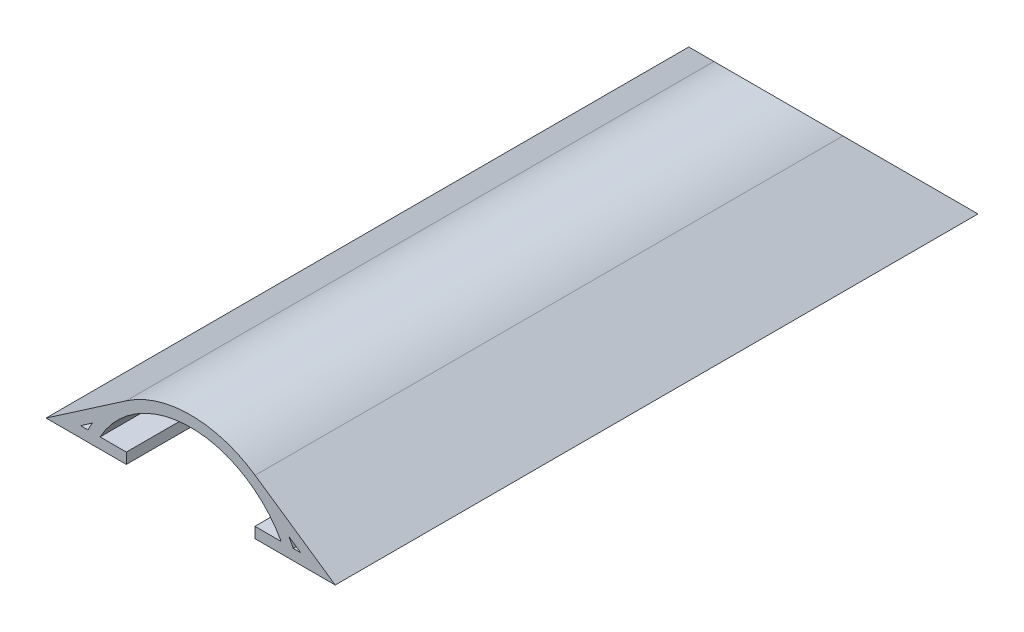
ISO-10303-21;
HEADER;
FILE_DESCRIPTION(('STEP AP214'),'2;1');
FILE_NAME('part.step','',(''),(''),'','','');
FILE_SCHEMA(('AUTOMOTIVE_DESIGN { 1 0 10303 214 1 1 1 1 }'));
ENDSEC;
DATA;
#1=APPLICATION_CONTEXT('core data for automotive mechanical design processes');
#2=APPLICATION_PROTOCOL_DEFINITION('international standard','automotive_design',2000,#1);
#3=PRODUCT_CONTEXT('',#1,'mechanical');
#4=PRODUCT('Part','Part','',(#3));
#5=PRODUCT_RELATED_PRODUCT_CATEGORY('part','',(#4));
#6=PRODUCT_DEFINITION_FORMATION('','',#4);
#7=PRODUCT_DEFINITION_CONTEXT('part definition',#1,'design');
#8=PRODUCT_DEFINITION('design','',#6,#7);
#9=PRODUCT_DEFINITION_SHAPE('','',#8);
#10=(LENGTH_UNIT() NAMED_UNIT(*) SI_UNIT(.MILLI.,.METRE.));
#11=(NAMED_UNIT(*) PLANE_ANGLE_UNIT() SI_UNIT($,.RADIAN.));
#12=(NAMED_UNIT(*) SI_UNIT($,.STERADIAN.) SOLID_ANGLE_UNIT());
#13=UNCERTAINTY_MEASURE_WITH_UNIT(LENGTH_MEASURE(1.E-05),#10,'distance_accuracy_value','');
#14=(GEOMETRIC_REPRESENTATION_CONTEXT(3) GLOBAL_UNCERTAINTY_ASSIGNED_CONTEXT((#13)) GLOBAL_UNIT_ASSIGNED_CONTEXT((#10,
#11,#12)) REPRESENTATION_CONTEXT('',''));
#15=CARTESIAN_POINT('',(0.,0.,0.));
#16=DIRECTION('',(0.,0.,1.));
#17=DIRECTION('',(1.,0.,0.));
#18=AXIS2_PLACEMENT_3D('',#15,#16,#17);
#19=CARTESIAN_POINT('',(34.29,-9.25285714285715,152.4));
#20=DIRECTION('',(0.,0.,-1.));
#21=DIRECTION('',(-1.,0.,0.));
#22=AXIS2_PLACEMENT_3D('',#19,#20,#21);
#23=CYLINDRICAL_SURFACE('',#22,27.0328571428572);
#24=CARTESIAN_POINT('',(34.29,-9.25285714285715,-9.25285714285704));
#25=DIRECTION('',(0.,0.707106781186544,-0.707106781186551));
#26=DIRECTION('',(0.,-0.707106781186551,-0.707106781186544));
#27=AXIS2_PLACEMENT_3D('',#24,#25,#26);
#28=ELLIPSE('',#27,38.2302332011228,27.0328571428572);
#29=CARTESIAN_POINT('',(18.9926798567758,13.0354214300123,13.0354214300122));
#30=VERTEX_POINT('',#29);
#31=CARTESIAN_POINT('',(49.5873201432242,13.0354214300123,13.0354214300122));
#32=VERTEX_POINT('',#31);
#33=EDGE_CURVE('E54',#30,#32,#28,.T.);
#34=ORIENTED_EDGE('',*,*,#33,.F.);
#35=DIRECTION('',(0.,0.,-1.));
#36=VECTOR('',#35,1.);
#37=CARTESIAN_POINT('',(18.9926798567758,13.0354214300123,152.4));
#38=LINE('',#37,#36);
#39=CARTESIAN_POINT('',(18.9926798567758,13.0354214300123,152.4));
#40=VERTEX_POINT('',#39);
#41=EDGE_CURVE('E39',#40,#30,#38,.T.);
#42=ORIENTED_EDGE('',*,*,#41,.F.);
#43=CARTESIAN_POINT('',(34.29,-9.25285714285715,152.4));
#44=DIRECTION('',(0.,0.,1.));
#45=DIRECTION('',(1.,0.,0.));
#46=AXIS2_PLACEMENT_3D('',#43,#44,#45);
#47=CIRCLE('',#46,27.0328571428572);
#48=CARTESIAN_POINT('',(49.5873201432242,13.0354214300123,152.4));
#49=VERTEX_POINT('',#48);
#50=EDGE_CURVE('E214',#49,#40,#47,.T.);
#51=ORIENTED_EDGE('',*,*,#50,.F.);
#52=DIRECTION('',(0.,0.,-1.));
#53=VECTOR('',#52,1.);
#54=CARTESIAN_POINT('',(49.5873201432242,13.0354214300123,152.4));
#55=LINE('',#54,#53);
#56=EDGE_CURVE('E223',#49,#32,#55,.T.);
#57=ORIENTED_EDGE('',*,*,#56,.T.);
#58=EDGE_LOOP('',(#34,#42,#51,#57));
#59=FACE_BOUND('',#58,.T.);
#60=ADVANCED_FACE('F32',(#59),#23,.T.);
#61=CARTESIAN_POINT('',(18.9926798567758,13.0354214300123,152.4));
#62=DIRECTION('',(0.565878777163079,-0.824488453258394,0.));
#63=DIRECTION('',(0.824488453258394,0.565878777163079,0.));
#64=AXIS2_PLACEMENT_3D('',#61,#62,#63);
#65=PLANE('',#64);
#66=DIRECTION('',(0.717565620621447,0.492493441632557,0.492493441632552));
#67=VECTOR('',#66,1.);
#68=CARTESIAN_POINT('',(68.2436149285987,46.8382707027199,46.8382707027194));
#69=LINE('',#68,#67);
#70=CARTESIAN_POINT('',(0.,0.,0.));
#71=VERTEX_POINT('',#70);
#72=EDGE_CURVE('E239',#71,#30,#69,.T.);
#73=ORIENTED_EDGE('',*,*,#72,.F.);
#74=DIRECTION('',(0.,0.,-1.));
#75=VECTOR('',#74,1.);
#76=CARTESIAN_POINT('',(0.,0.,152.4));
#77=LINE('',#76,#75);
#78=CARTESIAN_POINT('',(0.,0.,152.4));
#79=VERTEX_POINT('',#78);
#80=EDGE_CURVE('E231',#79,#71,#77,.T.);
#81=ORIENTED_EDGE('',*,*,#80,.F.);
#82=DIRECTION('',(-0.824488453258394,-0.565878777163079,0.));
#83=VECTOR('',#82,1.);
#84=CARTESIAN_POINT('',(18.9926798567758,13.0354214300123,152.4));
#85=LINE('',#84,#83);
#86=EDGE_CURVE('E217',#40,#79,#85,.T.);
#87=ORIENTED_EDGE('',*,*,#86,.F.);
#88=ORIENTED_EDGE('',*,*,#41,.T.);
#89=EDGE_LOOP('',(#73,#81,#87,#88));
#90=FACE_BOUND('',#89,.T.);
#91=ADVANCED_FACE('F237',(#90),#65,.F.);
#92=CARTESIAN_POINT('',(49.5873201432242,13.0354214300123,152.4));
#93=DIRECTION('',(-0.565878777163079,-0.824488453258394,0.));
#94=DIRECTION('',(0.824488453258394,-0.565878777163079,0.));
#95=AXIS2_PLACEMENT_3D('',#92,#93,#94);
#96=PLANE('',#95);
#97=DIRECTION('',(0.717565620621447,-0.492493441632557,-0.492493441632552));
#98=VECTOR('',#97,1.);
#99=CARTESIAN_POINT('',(0.336385071401331,46.8382707027199,46.8382707027194));
#100=LINE('',#99,#98);
#101=CARTESIAN_POINT('',(68.58,0.,0.));
#102=VERTEX_POINT('',#101);
#103=EDGE_CURVE('E243',#32,#102,#100,.T.);
#104=ORIENTED_EDGE('',*,*,#103,.F.);
#105=ORIENTED_EDGE('',*,*,#56,.F.);
#106=DIRECTION('',(-0.824488453258394,0.565878777163079,0.));
#107=VECTOR('',#106,1.);
#108=CARTESIAN_POINT('',(49.5873201432242,13.0354214300123,152.4));
#109=LINE('',#108,#107);
#110=CARTESIAN_POINT('',(68.58,0.,152.4));
#111=VERTEX_POINT('',#110);
#112=EDGE_CURVE('E221',#111,#49,#109,.T.);
#113=ORIENTED_EDGE('',*,*,#112,.F.);
#114=DIRECTION('',(0.,0.,-1.));
#115=VECTOR('',#114,1.);
#116=CARTESIAN_POINT('',(68.58,0.,152.4));
#117=LINE('',#116,#115);
#118=EDGE_CURVE('E228',#111,#102,#117,.T.);
#119=ORIENTED_EDGE('',*,*,#118,.T.);
#120=EDGE_LOOP('',(#104,#105,#113,#119));
#121=FACE_BOUND('',#120,.T.);
#122=ADVANCED_FACE('F297',(#121),#96,.F.);
#123=CARTESIAN_POINT('',(8.18938765385225,2.54,152.4));
#124=DIRECTION('',(0.,1.,0.));
#125=DIRECTION('',(-1.,0.,0.));
#126=AXIS2_PLACEMENT_3D('',#123,#124,#125);
#127=PLANE('',#126);
#128=DIRECTION('',(0.,0.,-1.));
#129=VECTOR('',#128,1.);
#130=CARTESIAN_POINT('',(9.9650357510173,2.54,152.4));
#131=LINE('',#130,#129);
#132=CARTESIAN_POINT('',(9.9650357510173,2.54,152.4));
#133=VERTEX_POINT('',#132);
#134=CARTESIAN_POINT('',(9.9650357510173,2.54,2.53999999999999));
#135=VERTEX_POINT('',#134);
#136=EDGE_CURVE('E210',#133,#135,#131,.T.);
#137=ORIENTED_EDGE('',*,*,#136,.T.);
#138=DIRECTION('',(-1.,0.,0.));
#139=VECTOR('',#138,1.);
#140=CARTESIAN_POINT('',(8.18938765385228,2.54,2.53999999999999));
#141=LINE('',#140,#139);
#142=CARTESIAN_POINT('',(8.18938765385226,2.54,2.53999999999999));
#143=VERTEX_POINT('',#142);
#144=EDGE_CURVE('E245',#135,#143,#141,.T.);
#145=ORIENTED_EDGE('',*,*,#144,.T.);
#146=DIRECTION('',(0.,0.,-1.));
#147=VECTOR('',#146,1.);
#148=CARTESIAN_POINT('',(8.18938765385225,2.54,152.4));
#149=LINE('',#148,#147);
#150=CARTESIAN_POINT('',(8.18938765385225,2.54,152.4));
#151=VERTEX_POINT('',#150);
#152=EDGE_CURVE('E204',#151,#143,#149,.T.);
#153=ORIENTED_EDGE('',*,*,#152,.F.);
#154=DIRECTION('',(1.,0.,0.));
#155=VECTOR('',#154,1.);
#156=CARTESIAN_POINT('',(8.18938765385225,2.54,152.4));
#157=LINE('',#156,#155);
#158=EDGE_CURVE('E197',#151,#133,#157,.T.);
#159=ORIENTED_EDGE('',*,*,#158,.T.);
#160=EDGE_LOOP('',(#137,#145,#153,#159));
#161=FACE_BOUND('',#160,.T.);
#162=ADVANCED_FACE('F316',(#161),#127,.T.);
#163=CARTESIAN_POINT('',(34.29,-9.25285714285715,152.4));
#164=DIRECTION('',(0.,0.,-1.));
#165=DIRECTION('',(-1.,0.,0.));
#166=AXIS2_PLACEMENT_3D('',#163,#164,#165);
#167=CYLINDRICAL_SURFACE('',#166,27.0328571428572);
#168=DIRECTION('',(0.,0.,-1.));
#169=VECTOR('',#168,1.);
#170=CARTESIAN_POINT('',(10.9978022708371,4.46752514961934,152.4));
#171=LINE('',#170,#169);
#172=CARTESIAN_POINT('',(10.9978022708371,4.46752514961934,152.4));
#173=VERTEX_POINT('',#172);
#174=CARTESIAN_POINT('',(10.9978022708371,4.46752514961934,4.4675251496193));
#175=VERTEX_POINT('',#174);
#176=EDGE_CURVE('E207',#173,#175,#171,.T.);
#177=ORIENTED_EDGE('',*,*,#176,.T.);
#178=CARTESIAN_POINT('',(34.29,-9.25285714285715,-9.25285714285704));
#179=DIRECTION('',(0.,0.707106781186544,-0.707106781186551));
#180=DIRECTION('',(0.,-0.707106781186551,-0.707106781186544));
#181=AXIS2_PLACEMENT_3D('',#178,#179,#180);
#182=ELLIPSE('',#181,38.2302332011228,27.0328571428572);
#183=EDGE_CURVE('E250',#175,#135,#182,.F.);
#184=ORIENTED_EDGE('',*,*,#183,.T.);
#185=ORIENTED_EDGE('',*,*,#136,.F.);
#186=CARTESIAN_POINT('',(34.29,-9.25285714285715,152.4));
#187=DIRECTION('',(0.,0.,-1.));
#188=DIRECTION('',(1.,0.,0.));
#189=AXIS2_PLACEMENT_3D('',#186,#187,#188);
#190=CIRCLE('',#189,27.0328571428572);
#191=EDGE_CURVE('E199',#133,#173,#190,.T.);
#192=ORIENTED_EDGE('',*,*,#191,.T.);
#193=EDGE_LOOP('',(#177,#184,#185,#192));
#194=FACE_BOUND('',#193,.T.);
#195=ADVANCED_FACE('F325',(#194),#167,.T.);
#196=CARTESIAN_POINT('',(10.9978022708371,4.46752514961934,152.4));
#197=DIRECTION('',(0.565878777163076,-0.824488453258395,0.));
#198=DIRECTION('',(0.824488453258396,0.565878777163077,0.));
#199=AXIS2_PLACEMENT_3D('',#196,#197,#198);
#200=PLANE('',#199);
#201=ORIENTED_EDGE('',*,*,#152,.T.);
#202=DIRECTION('',(0.717565620621449,0.492493441632556,0.492493441632551));
#203=VECTOR('',#202,1.);
#204=CARTESIAN_POINT('',(63.2766007189757,40.3485158663154,40.348515866315));
#205=LINE('',#204,#203);
#206=EDGE_CURVE('E253',#143,#175,#205,.T.);
#207=ORIENTED_EDGE('',*,*,#206,.T.);
#208=ORIENTED_EDGE('',*,*,#176,.F.);
#209=DIRECTION('',(-0.824488453258395,-0.565878777163076,0.));
#210=VECTOR('',#209,1.);
#211=CARTESIAN_POINT('',(10.9978022708371,4.46752514961934,152.4));
#212=LINE('',#211,#210);
#213=EDGE_CURVE('E202',#173,#151,#212,.T.);
#214=ORIENTED_EDGE('',*,*,#213,.T.);
#215=EDGE_LOOP('',(#201,#207,#208,#214));
#216=FACE_BOUND('',#215,.T.);
#217=ADVANCED_FACE('F329',(#216),#200,.T.);
#218=CARTESIAN_POINT('',(58.6149642489827,2.54,152.4));
#219=DIRECTION('',(0.,1.,0.));
#220=DIRECTION('',(-1.,0.,0.));
#221=AXIS2_PLACEMENT_3D('',#218,#219,#220);
#222=PLANE('',#221);
#223=DIRECTION('',(0.,0.,-1.));
#224=VECTOR('',#223,1.);
#225=CARTESIAN_POINT('',(60.3906123461478,2.54,152.4));
#226=LINE('',#225,#224);
#227=CARTESIAN_POINT('',(60.3906123461478,2.54,152.4));
#228=VERTEX_POINT('',#227);
#229=CARTESIAN_POINT('',(60.3906123461478,2.54,2.54000000000001));
#230=VERTEX_POINT('',#229);
#231=EDGE_CURVE('E194',#228,#230,#226,.T.);
#232=ORIENTED_EDGE('',*,*,#231,.T.);
#233=DIRECTION('',(-1.,0.,0.));
#234=VECTOR('',#233,1.);
#235=CARTESIAN_POINT('',(58.6149642489826,2.54,2.53999999999999));
#236=LINE('',#235,#234);
#237=CARTESIAN_POINT('',(58.6149642489827,2.54,2.53999999999999));
#238=VERTEX_POINT('',#237);
#239=EDGE_CURVE('E256',#230,#238,#236,.T.);
#240=ORIENTED_EDGE('',*,*,#239,.T.);
#241=DIRECTION('',(0.,0.,-1.));
#242=VECTOR('',#241,1.);
#243=CARTESIAN_POINT('',(58.6149642489827,2.54,152.4));
#244=LINE('',#243,#242);
#245=CARTESIAN_POINT('',(58.6149642489827,2.54,152.4));
#246=VERTEX_POINT('',#245);
#247=EDGE_CURVE('E188',#246,#238,#244,.T.);
#248=ORIENTED_EDGE('',*,*,#247,.F.);
#249=DIRECTION('',(1.,0.,0.));
#250=VECTOR('',#249,1.);
#251=CARTESIAN_POINT('',(58.6149642489827,2.54,152.4));
#252=LINE('',#251,#250);
#253=EDGE_CURVE('E181',#246,#228,#252,.T.);
#254=ORIENTED_EDGE('',*,*,#253,.T.);
#255=EDGE_LOOP('',(#232,#240,#248,#254));
#256=FACE_BOUND('',#255,.T.);
#257=ADVANCED_FACE('F333',(#256),#222,.T.);
#258=CARTESIAN_POINT('',(57.5821977291629,4.46752514961935,152.4));
#259=DIRECTION('',(-0.565878777163076,-0.824488453258395,0.));
#260=DIRECTION('',(0.824488453258396,-0.565878777163076,0.));
#261=AXIS2_PLACEMENT_3D('',#258,#259,#260);
#262=PLANE('',#261);
#263=DIRECTION('',(0.,0.,-1.));
#264=VECTOR('',#263,1.);
#265=CARTESIAN_POINT('',(57.5821977291629,4.46752514961935,152.4));
#266=LINE('',#265,#264);
#267=CARTESIAN_POINT('',(57.5821977291629,4.46752514961936,152.4));
#268=VERTEX_POINT('',#267);
#269=CARTESIAN_POINT('',(57.5821977291629,4.46752514961935,4.46752514961934));
#270=VERTEX_POINT('',#269);
#271=EDGE_CURVE('E191',#268,#270,#266,.T.);
#272=ORIENTED_EDGE('',*,*,#271,.T.);
#273=DIRECTION('',(0.717565620621449,-0.492493441632556,-0.492493441632551));
#274=VECTOR('',#273,1.);
#275=CARTESIAN_POINT('',(5.30339928102429,40.3485158663154,40.348515866315));
#276=LINE('',#275,#274);
#277=EDGE_CURVE('E259',#270,#230,#276,.T.);
#278=ORIENTED_EDGE('',*,*,#277,.T.);
#279=ORIENTED_EDGE('',*,*,#231,.F.);
#280=DIRECTION('',(-0.824488453258395,0.565878777163076,0.));
#281=VECTOR('',#280,1.);
#282=CARTESIAN_POINT('',(57.5821977291629,4.46752514961935,152.4));
#283=LINE('',#282,#281);
#284=EDGE_CURVE('E183',#228,#268,#283,.T.);
#285=ORIENTED_EDGE('',*,*,#284,.T.);
#286=EDGE_LOOP('',(#272,#278,#279,#285));
#287=FACE_BOUND('',#286,.T.);
#288=ADVANCED_FACE('F337',(#287),#262,.T.);
#289=CARTESIAN_POINT('',(34.29,-9.25285714285715,152.4));
#290=DIRECTION('',(0.,0.,-1.));
#291=DIRECTION('',(-1.,0.,0.));
#292=AXIS2_PLACEMENT_3D('',#289,#290,#291);
#293=CYLINDRICAL_SURFACE('',#292,27.0328571428572);
#294=ORIENTED_EDGE('',*,*,#247,.T.);
#295=CARTESIAN_POINT('',(34.29,-9.25285714285715,-9.25285714285704));
#296=DIRECTION('',(0.,0.707106781186544,-0.707106781186551));
#297=DIRECTION('',(0.,-0.707106781186551,-0.707106781186544));
#298=AXIS2_PLACEMENT_3D('',#295,#296,#297);
#299=ELLIPSE('',#298,38.2302332011228,27.0328571428572);
#300=EDGE_CURVE('E262',#238,#270,#299,.F.);
#301=ORIENTED_EDGE('',*,*,#300,.T.);
#302=ORIENTED_EDGE('',*,*,#271,.F.);
#303=CARTESIAN_POINT('',(34.29,-9.25285714285715,152.4));
#304=DIRECTION('',(0.,0.,-1.));
#305=DIRECTION('',(1.,0.,0.));
#306=AXIS2_PLACEMENT_3D('',#303,#304,#305);
#307=CIRCLE('',#306,27.0328571428572);
#308=EDGE_CURVE('E186',#268,#246,#307,.T.);
#309=ORIENTED_EDGE('',*,*,#308,.T.);
#310=EDGE_LOOP('',(#294,#301,#302,#309));
#311=FACE_BOUND('',#310,.T.);
#312=ADVANCED_FACE('F341',(#311),#293,.T.);
#313=CARTESIAN_POINT('',(34.29,-9.25285714285715,152.4));
#314=DIRECTION('',(0.,0.,-1.));
#315=DIRECTION('',(-1.,0.,0.));
#316=AXIS2_PLACEMENT_3D('',#313,#314,#315);
#317=CYLINDRICAL_SURFACE('',#316,24.4928571428572);
#318=DIRECTION('',(0.,0.,-1.));
#319=VECTOR('',#318,1.);
#320=CARTESIAN_POINT('',(12.8230819298957,2.54,152.4));
#321=LINE('',#320,#319);
#322=CARTESIAN_POINT('',(12.8230819298957,2.54,152.4));
#323=VERTEX_POINT('',#322);
#324=CARTESIAN_POINT('',(12.8230819298957,2.54,2.54000000000004));
#325=VERTEX_POINT('',#324);
#326=EDGE_CURVE('E169',#323,#325,#321,.T.);
#327=ORIENTED_EDGE('',*,*,#326,.T.);
#328=CARTESIAN_POINT('',(34.29,-9.25285714285715,-9.25285714285704));
#329=DIRECTION('',(0.,0.707106781186544,-0.707106781186551));
#330=DIRECTION('',(0.,-0.707106781186551,-0.707106781186544));
#331=AXIS2_PLACEMENT_3D('',#328,#329,#330);
#332=ELLIPSE('',#331,34.6381307526951,24.4928571428572);
#333=CARTESIAN_POINT('',(55.7569180701043,2.54,2.53999999999999));
#334=VERTEX_POINT('',#333);
#335=EDGE_CURVE('E265',#325,#334,#332,.T.);
#336=ORIENTED_EDGE('',*,*,#335,.T.);
#337=DIRECTION('',(0.,0.,-1.));
#338=VECTOR('',#337,1.);
#339=CARTESIAN_POINT('',(55.7569180701043,2.54,152.4));
#340=LINE('',#339,#338);
#341=CARTESIAN_POINT('',(55.7569180701043,2.54,152.4));
#342=VERTEX_POINT('',#341);
#343=EDGE_CURVE('E171',#342,#334,#340,.T.);
#344=ORIENTED_EDGE('',*,*,#343,.F.);
#345=CARTESIAN_POINT('',(34.29,-9.25285714285715,152.4));
#346=DIRECTION('',(0.,0.,1.));
#347=DIRECTION('',(1.,0.,0.));
#348=AXIS2_PLACEMENT_3D('',#345,#346,#347);
#349=CIRCLE('',#348,24.4928571428572);
#350=EDGE_CURVE('E176',#342,#323,#349,.T.);
#351=ORIENTED_EDGE('',*,*,#350,.T.);
#352=EDGE_LOOP('',(#327,#336,#344,#351));
#353=FACE_BOUND('',#352,.T.);
#354=ADVANCED_FACE('F285',(#353),#317,.F.);
#355=CARTESIAN_POINT('',(12.8230819298957,2.54,152.4));
#356=DIRECTION('',(0.,1.,0.));
#357=DIRECTION('',(0.,0.,1.));
#358=AXIS2_PLACEMENT_3D('',#355,#356,#357);
#359=PLANE('',#358);
#360=DIRECTION('',(0.,0.,1.));
#361=VECTOR('',#360,1.);
#362=CARTESIAN_POINT('',(49.53,2.54,152.4));
#363=LINE('',#362,#361);
#364=CARTESIAN_POINT('',(49.53,2.54,114.3));
#365=VERTEX_POINT('',#364);
#366=CARTESIAN_POINT('',(49.53,2.54,152.4));
#367=VERTEX_POINT('',#366);
#368=EDGE_CURVE('E151',#365,#367,#363,.T.);
#369=ORIENTED_EDGE('',*,*,#368,.T.);
#370=DIRECTION('',(1.,0.,0.));
#371=VECTOR('',#370,1.);
#372=CARTESIAN_POINT('',(12.8230819298957,2.54,152.4));
#373=LINE('',#372,#371);
#374=EDGE_CURVE('E172',#367,#342,#373,.T.);
#375=ORIENTED_EDGE('',*,*,#374,.T.);
#376=ORIENTED_EDGE('',*,*,#343,.T.);
#377=DIRECTION('',(-1.,0.,0.));
#378=VECTOR('',#377,1.);
#379=CARTESIAN_POINT('',(12.8230819298957,2.54,2.53999999999999));
#380=LINE('',#379,#378);
#381=EDGE_CURVE('E11',#334,#325,#380,.T.);
#382=ORIENTED_EDGE('',*,*,#381,.T.);
#383=ORIENTED_EDGE('',*,*,#326,.F.);
#384=CARTESIAN_POINT('',(19.05,2.54,152.4));
#385=VERTEX_POINT('',#384);
#386=EDGE_CURVE('E160',#323,#385,#373,.T.);
#387=ORIENTED_EDGE('',*,*,#386,.T.);
#388=DIRECTION('',(0.,0.,-1.));
#389=VECTOR('',#388,1.);
#390=CARTESIAN_POINT('',(19.05,2.54,152.4));
#391=LINE('',#390,#389);
#392=CARTESIAN_POINT('',(19.05,2.54,114.3));
#393=VERTEX_POINT('',#392);
#394=EDGE_CURVE('E144',#385,#393,#391,.T.);
#395=ORIENTED_EDGE('',*,*,#394,.T.);
#396=DIRECTION('',(1.,0.,0.));
#397=VECTOR('',#396,1.);
#398=CARTESIAN_POINT('',(19.05,2.54,114.3));
#399=LINE('',#398,#397);
#400=EDGE_CURVE('E163',#393,#365,#399,.T.);
#401=ORIENTED_EDGE('',*,*,#400,.T.);
#402=EDGE_LOOP('',(#369,#375,#376,#382,#383,#387,#395,#401));
#403=FACE_BOUND('',#402,.T.);
#404=ADVANCED_FACE('F167',(#403),#359,.T.);
#405=CARTESIAN_POINT('',(34.29,-9.25285714285715,152.4));
#406=DIRECTION('',(0.,0.,1.));
#407=DIRECTION('',(1.,0.,0.));
#408=AXIS2_PLACEMENT_3D('',#405,#406,#407);
#409=PLANE('',#408);
#410=DIRECTION('',(0.,-1.,0.));
#411=VECTOR('',#410,1.);
#412=CARTESIAN_POINT('',(49.53,17.781,152.4));
#413=LINE('',#412,#411);
#414=CARTESIAN_POINT('',(49.53,0.,152.4));
#415=VERTEX_POINT('',#414);
#416=EDGE_CURVE('E164',#367,#415,#413,.T.);
#417=ORIENTED_EDGE('',*,*,#416,.T.);
#418=DIRECTION('',(1.,0.,0.));
#419=VECTOR('',#418,1.);
#420=CARTESIAN_POINT('',(0.,0.,152.4));
#421=LINE('',#420,#419);
#422=EDGE_CURVE('E219',#415,#111,#421,.T.);
#423=ORIENTED_EDGE('',*,*,#422,.T.);
#424=ORIENTED_EDGE('',*,*,#112,.T.);
#425=ORIENTED_EDGE('',*,*,#50,.T.);
#426=ORIENTED_EDGE('',*,*,#86,.T.);
#427=CARTESIAN_POINT('',(19.05,0.,152.4));
#428=VERTEX_POINT('',#427);
#429=EDGE_CURVE('E162',#79,#428,#421,.T.);
#430=ORIENTED_EDGE('',*,*,#429,.T.);
#431=DIRECTION('',(0.,-1.,0.));
#432=VECTOR('',#431,1.);
#433=CARTESIAN_POINT('',(19.05,17.781,152.4));
#434=LINE('',#433,#432);
#435=EDGE_CURVE('E46',#385,#428,#434,.T.);
#436=ORIENTED_EDGE('',*,*,#435,.F.);
#437=ORIENTED_EDGE('',*,*,#386,.F.);
#438=ORIENTED_EDGE('',*,*,#350,.F.);
#439=ORIENTED_EDGE('',*,*,#374,.F.);
#440=EDGE_LOOP('',(#417,#423,#424,#425,#426,#430,#436,#437,#438,#439));
#441=FACE_BOUND('',#440,.T.);
#442=ORIENTED_EDGE('',*,*,#191,.F.);
#443=ORIENTED_EDGE('',*,*,#158,.F.);
#444=ORIENTED_EDGE('',*,*,#213,.F.);
#445=EDGE_LOOP('',(#442,#443,#444));
#446=FACE_BOUND('',#445,.T.);
#447=ORIENTED_EDGE('',*,*,#284,.F.);
#448=ORIENTED_EDGE('',*,*,#253,.F.);
#449=ORIENTED_EDGE('',*,*,#308,.F.);
#450=EDGE_LOOP('',(#447,#448,#449));
#451=FACE_BOUND('',#450,.T.);
#452=ADVANCED_FACE('F157',(#441,#446,#451),#409,.T.);
#453=CARTESIAN_POINT('',(0.,0.,152.4));
#454=DIRECTION('',(0.,1.,0.));
#455=DIRECTION('',(0.,0.,1.));
#456=AXIS2_PLACEMENT_3D('',#453,#454,#455);
#457=PLANE('',#456);
#458=ORIENTED_EDGE('',*,*,#422,.F.);
#459=DIRECTION('',(0.,0.,1.));
#460=VECTOR('',#459,1.);
#461=CARTESIAN_POINT('',(49.53,0.,152.4));
#462=LINE('',#461,#460);
#463=CARTESIAN_POINT('',(49.53,0.,114.3));
#464=VERTEX_POINT('',#463);
#465=EDGE_CURVE('E271',#464,#415,#462,.T.);
#466=ORIENTED_EDGE('',*,*,#465,.F.);
#467=DIRECTION('',(1.,0.,0.));
#468=VECTOR('',#467,1.);
#469=CARTESIAN_POINT('',(19.05,0.,114.3));
#470=LINE('',#469,#468);
#471=CARTESIAN_POINT('',(19.05,0.,114.3));
#472=VERTEX_POINT('',#471);
#473=EDGE_CURVE('E275',#472,#464,#470,.T.);
#474=ORIENTED_EDGE('',*,*,#473,.F.);
#475=DIRECTION('',(0.,0.,-1.));
#476=VECTOR('',#475,1.);
#477=CARTESIAN_POINT('',(19.05,0.,152.4));
#478=LINE('',#477,#476);
#479=EDGE_CURVE('E150',#428,#472,#478,.T.);
#480=ORIENTED_EDGE('',*,*,#479,.F.);
#481=ORIENTED_EDGE('',*,*,#429,.F.);
#482=ORIENTED_EDGE('',*,*,#80,.T.);
#483=DIRECTION('',(1.,0.,0.));
#484=VECTOR('',#483,1.);
#485=CARTESIAN_POINT('',(0.,0.,0.));
#486=LINE('',#485,#484);
#487=EDGE_CURVE('E213',#71,#102,#486,.T.);
#488=ORIENTED_EDGE('',*,*,#487,.T.);
#489=ORIENTED_EDGE('',*,*,#118,.F.);
#490=EDGE_LOOP('',(#458,#466,#474,#480,#481,#482,#488,#489));
#491=FACE_BOUND('',#490,.T.);
#492=ADVANCED_FACE('F290',(#491),#457,.F.);
#493=CARTESIAN_POINT('',(68.58,17.78,17.7799999999998));
#494=DIRECTION('',(0.,0.707106781186544,-0.707106781186551));
#495=DIRECTION('',(0.,0.707106781186551,0.707106781186544));
#496=AXIS2_PLACEMENT_3D('',#493,#494,#495);
#497=PLANE('',#496);
#498=ORIENTED_EDGE('',*,*,#183,.F.);
#499=ORIENTED_EDGE('',*,*,#206,.F.);
#500=ORIENTED_EDGE('',*,*,#144,.F.);
#501=EDGE_LOOP('',(#498,#499,#500));
#502=FACE_BOUND('',#501,.T.);
#503=ORIENTED_EDGE('',*,*,#277,.F.);
#504=ORIENTED_EDGE('',*,*,#300,.F.);
#505=ORIENTED_EDGE('',*,*,#239,.F.);
#506=EDGE_LOOP('',(#503,#504,#505));
#507=FACE_BOUND('',#506,.T.);
#508=ORIENTED_EDGE('',*,*,#381,.F.);
#509=ORIENTED_EDGE('',*,*,#335,.F.);
#510=EDGE_LOOP('',(#508,#509));
#511=FACE_BOUND('',#510,.T.);
#512=ORIENTED_EDGE('',*,*,#72,.T.);
#513=ORIENTED_EDGE('',*,*,#33,.T.);
#514=ORIENTED_EDGE('',*,*,#103,.T.);
#515=ORIENTED_EDGE('',*,*,#487,.F.);
#516=EDGE_LOOP('',(#512,#513,#514,#515));
#517=FACE_BOUND('',#516,.T.);
#518=ADVANCED_FACE('F287',(#502,#507,#511,#517),#497,.T.);
#519=CARTESIAN_POINT('',(19.05,17.781,114.3));
#520=DIRECTION('',(0.,0.,-1.));
#521=DIRECTION('',(-1.,0.,0.));
#522=AXIS2_PLACEMENT_3D('',#519,#520,#521);
#523=PLANE('',#522);
#524=DIRECTION('',(0.,-1.,0.));
#525=VECTOR('',#524,1.);
#526=CARTESIAN_POINT('',(19.05,17.781,114.3));
#527=LINE('',#526,#525);
#528=EDGE_CURVE('E146',#393,#472,#527,.T.);
#529=ORIENTED_EDGE('',*,*,#528,.T.);
#530=ORIENTED_EDGE('',*,*,#473,.T.);
#531=DIRECTION('',(0.,-1.,0.));
#532=VECTOR('',#531,1.);
#533=CARTESIAN_POINT('',(49.53,17.781,114.3));
#534=LINE('',#533,#532);
#535=EDGE_CURVE('E270',#365,#464,#534,.T.);
#536=ORIENTED_EDGE('',*,*,#535,.F.);
#537=ORIENTED_EDGE('',*,*,#400,.F.);
#538=EDGE_LOOP('',(#529,#530,#536,#537));
#539=FACE_BOUND('',#538,.T.);
#540=ADVANCED_FACE('F289',(#539),#523,.F.);
#541=CARTESIAN_POINT('',(49.53,17.781,152.4));
#542=DIRECTION('',(1.,0.,0.));
#543=DIRECTION('',(0.,0.,-1.));
#544=AXIS2_PLACEMENT_3D('',#541,#542,#543);
#545=PLANE('',#544);
#546=ORIENTED_EDGE('',*,*,#535,.T.);
#547=ORIENTED_EDGE('',*,*,#465,.T.);
#548=ORIENTED_EDGE('',*,*,#416,.F.);
#549=ORIENTED_EDGE('',*,*,#368,.F.);
#550=EDGE_LOOP('',(#546,#547,#548,#549));
#551=FACE_BOUND('',#550,.T.);
#552=ADVANCED_FACE('F300',(#551),#545,.F.);
#553=CARTESIAN_POINT('',(19.05,17.781,152.4));
#554=DIRECTION('',(-1.,0.,0.));
#555=DIRECTION('',(0.,0.,1.));
#556=AXIS2_PLACEMENT_3D('',#553,#554,#555);
#557=PLANE('',#556);
#558=ORIENTED_EDGE('',*,*,#435,.T.);
#559=ORIENTED_EDGE('',*,*,#479,.T.);
#560=ORIENTED_EDGE('',*,*,#528,.F.);
#561=ORIENTED_EDGE('',*,*,#394,.F.);
#562=EDGE_LOOP('',(#558,#559,#560,#561));
#563=FACE_BOUND('',#562,.T.);
#564=ADVANCED_FACE('F145',(#563),#557,.F.);
#565=CLOSED_SHELL('',(#60,#91,#122,#162,#195,#217,#257,#288,#312,#354,#404,#452,#492,#518,#540,
#552,#564));
#566=MANIFOLD_SOLID_BREP('B2',#565);
#567=ADVANCED_BREP_SHAPE_REPRESENTATION('',(#18,#566),#14);
#568=SHAPE_DEFINITION_REPRESENTATION(#9,#567);
ENDSEC;
END-ISO-10303-21;
